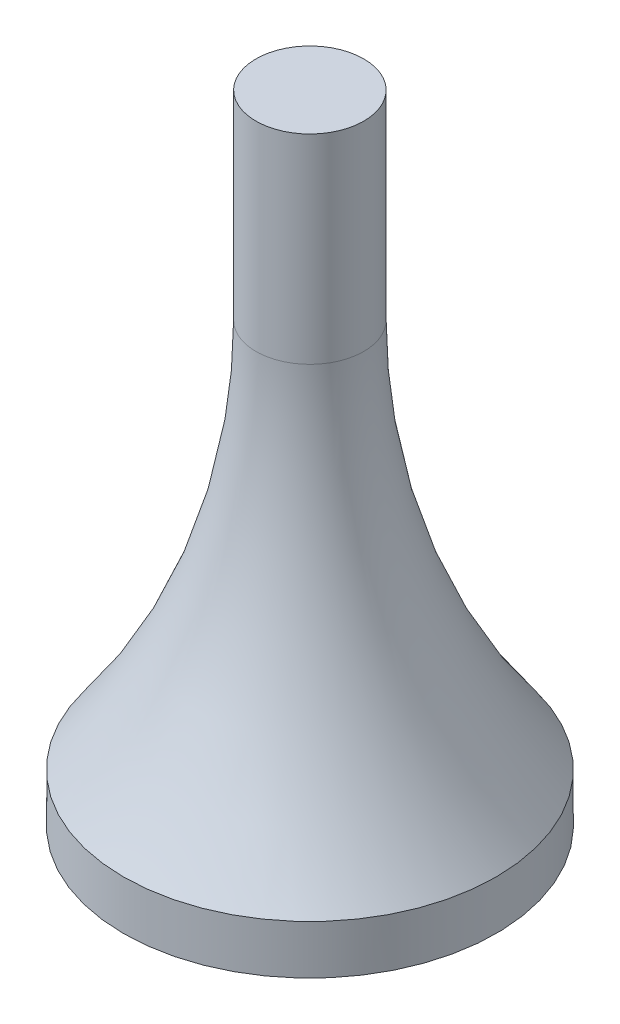
ISO-10303-21;
HEADER;
FILE_DESCRIPTION(('STEP AP214'),'2;1');
FILE_NAME('part.step','',(''),(''),'','','');
FILE_SCHEMA(('AUTOMOTIVE_DESIGN { 1 0 10303 214 1 1 1 1 }'));
ENDSEC;
DATA;
#1=APPLICATION_CONTEXT('core data for automotive mechanical design processes');
#2=APPLICATION_PROTOCOL_DEFINITION('international standard','automotive_design',2000,#1);
#3=PRODUCT_CONTEXT('',#1,'mechanical');
#4=PRODUCT('Part','Part','',(#3));
#5=PRODUCT_RELATED_PRODUCT_CATEGORY('part','',(#4));
#6=PRODUCT_DEFINITION_FORMATION('','',#4);
#7=PRODUCT_DEFINITION_CONTEXT('part definition',#1,'design');
#8=PRODUCT_DEFINITION('design','',#6,#7);
#9=PRODUCT_DEFINITION_SHAPE('','',#8);
#10=(LENGTH_UNIT() NAMED_UNIT(*) SI_UNIT(.MILLI.,.METRE.));
#11=(NAMED_UNIT(*) PLANE_ANGLE_UNIT() SI_UNIT($,.RADIAN.));
#12=(NAMED_UNIT(*) SI_UNIT($,.STERADIAN.) SOLID_ANGLE_UNIT());
#13=UNCERTAINTY_MEASURE_WITH_UNIT(LENGTH_MEASURE(1.E-05),#10,'distance_accuracy_value','');
#14=(GEOMETRIC_REPRESENTATION_CONTEXT(3) GLOBAL_UNCERTAINTY_ASSIGNED_CONTEXT((#13)) GLOBAL_UNIT_ASSIGNED_CONTEXT((#10,
#11,#12)) REPRESENTATION_CONTEXT('',''));
#15=CARTESIAN_POINT('',(0.,0.,0.));
#16=DIRECTION('',(0.,0.,1.));
#17=DIRECTION('',(1.,0.,0.));
#18=AXIS2_PLACEMENT_3D('',#15,#16,#17);
#19=CARTESIAN_POINT('',(0.,10.,0.));
#20=DIRECTION('',(0.,-1.,0.));
#21=DIRECTION('',(0.,0.,-1.));
#22=AXIS2_PLACEMENT_3D('',#19,#20,#21);
#23=CYLINDRICAL_SURFACE('',#22,38.);
#24=CARTESIAN_POINT('',(0.,10.,0.));
#25=DIRECTION('',(0.,1.,0.));
#26=DIRECTION('',(0.,0.,1.));
#27=AXIS2_PLACEMENT_3D('',#24,#25,#26);
#28=CIRCLE('',#27,38.);
#29=CARTESIAN_POINT('',(0.,10.,38.));
#30=VERTEX_POINT('',#29);
#31=EDGE_CURVE('E44',#30,#30,#28,.T.);
#32=ORIENTED_EDGE('',*,*,#31,.F.);
#33=EDGE_LOOP('',(#32));
#34=FACE_BOUND('',#33,.T.);
#35=CARTESIAN_POINT('',(0.,0.,0.));
#36=DIRECTION('',(0.,1.,0.));
#37=DIRECTION('',(0.,0.,1.));
#38=AXIS2_PLACEMENT_3D('',#35,#36,#37);
#39=CIRCLE('',#38,38.);
#40=CARTESIAN_POINT('',(0.,0.,38.));
#41=VERTEX_POINT('',#40);
#42=EDGE_CURVE('E48',#41,#41,#39,.T.);
#43=ORIENTED_EDGE('',*,*,#42,.T.);
#44=EDGE_LOOP('',(#43));
#45=FACE_BOUND('',#44,.T.);
#46=ADVANCED_FACE('F37',(#34,#45),#23,.T.);
#47=CARTESIAN_POINT('',(0.,0.,0.));
#48=DIRECTION('',(0.,1.,0.));
#49=DIRECTION('',(0.,0.,1.));
#50=AXIS2_PLACEMENT_3D('',#47,#48,#49);
#51=PLANE('',#50);
#52=ORIENTED_EDGE('',*,*,#42,.F.);
#53=EDGE_LOOP('',(#52));
#54=FACE_BOUND('',#53,.T.);
#55=ADVANCED_FACE('F62',(#54),#51,.F.);
#56=CARTESIAN_POINT('',(0.,130.,0.));
#57=DIRECTION('',(0.,1.,0.));
#58=DIRECTION('',(0.,0.,1.));
#59=AXIS2_PLACEMENT_3D('',#56,#57,#58);
#60=PLANE('',#59);
#61=CARTESIAN_POINT('',(0.,130.,0.));
#62=DIRECTION('',(0.,-1.,0.));
#63=DIRECTION('',(0.,0.,-1.));
#64=AXIS2_PLACEMENT_3D('',#61,#62,#63);
#65=CIRCLE('',#64,11.);
#66=CARTESIAN_POINT('',(0.,130.,-11.));
#67=VERTEX_POINT('',#66);
#68=EDGE_CURVE('E53',#67,#67,#65,.T.);
#69=ORIENTED_EDGE('',*,*,#68,.F.);
#70=EDGE_LOOP('',(#69));
#71=FACE_BOUND('',#70,.T.);
#72=ADVANCED_FACE('F60',(#71),#60,.T.);
#73=CARTESIAN_POINT('',(0.,0.,0.));
#74=DIRECTION('',(0.,-1.,0.));
#75=DIRECTION('',(0.,0.,-1.));
#76=AXIS2_PLACEMENT_3D('',#73,#74,#75);
#77=CYLINDRICAL_SURFACE('',#76,11.);
#78=CARTESIAN_POINT('',(0.,89.3158243984137,0.));
#79=DIRECTION('',(0.,-1.,0.));
#80=DIRECTION('',(0.,0.,-1.));
#81=AXIS2_PLACEMENT_3D('',#78,#79,#80);
#82=CIRCLE('',#81,11.);
#83=CARTESIAN_POINT('',(0.,89.3158243984137,-11.));
#84=VERTEX_POINT('',#83);
#85=EDGE_CURVE('E10',#84,#84,#82,.F.);
#86=ORIENTED_EDGE('',*,*,#85,.T.);
#87=EDGE_LOOP('',(#86));
#88=FACE_BOUND('',#87,.T.);
#89=ORIENTED_EDGE('',*,*,#68,.T.);
#90=EDGE_LOOP('',(#89));
#91=FACE_BOUND('',#90,.T.);
#92=ADVANCED_FACE('F58',(#88,#91),#77,.T.);
#93=CARTESIAN_POINT('',(0.,89.3158243984137,0.));
#94=DIRECTION('',(0.,-1.,0.));
#95=DIRECTION('',(0.,0.,-1.));
#96=AXIS2_PLACEMENT_3D('',#93,#94,#95);
#97=TOROIDAL_SURFACE('',#96,141.,130.);
#98=ORIENTED_EDGE('',*,*,#85,.F.);
#99=EDGE_LOOP('',(#98));
#100=FACE_BOUND('',#99,.T.);
#101=ORIENTED_EDGE('',*,*,#31,.T.);
#102=EDGE_LOOP('',(#101));
#103=FACE_BOUND('',#102,.T.);
#104=ADVANCED_FACE('F39',(#100,#103),#97,.F.);
#105=CLOSED_SHELL('',(#46,#55,#72,#92,#104));
#106=MANIFOLD_SOLID_BREP('B2',#105);
#107=ADVANCED_BREP_SHAPE_REPRESENTATION('',(#18,#106),#14);
#108=SHAPE_DEFINITION_REPRESENTATION(#9,#107);
ENDSEC;
END-ISO-10303-21;
